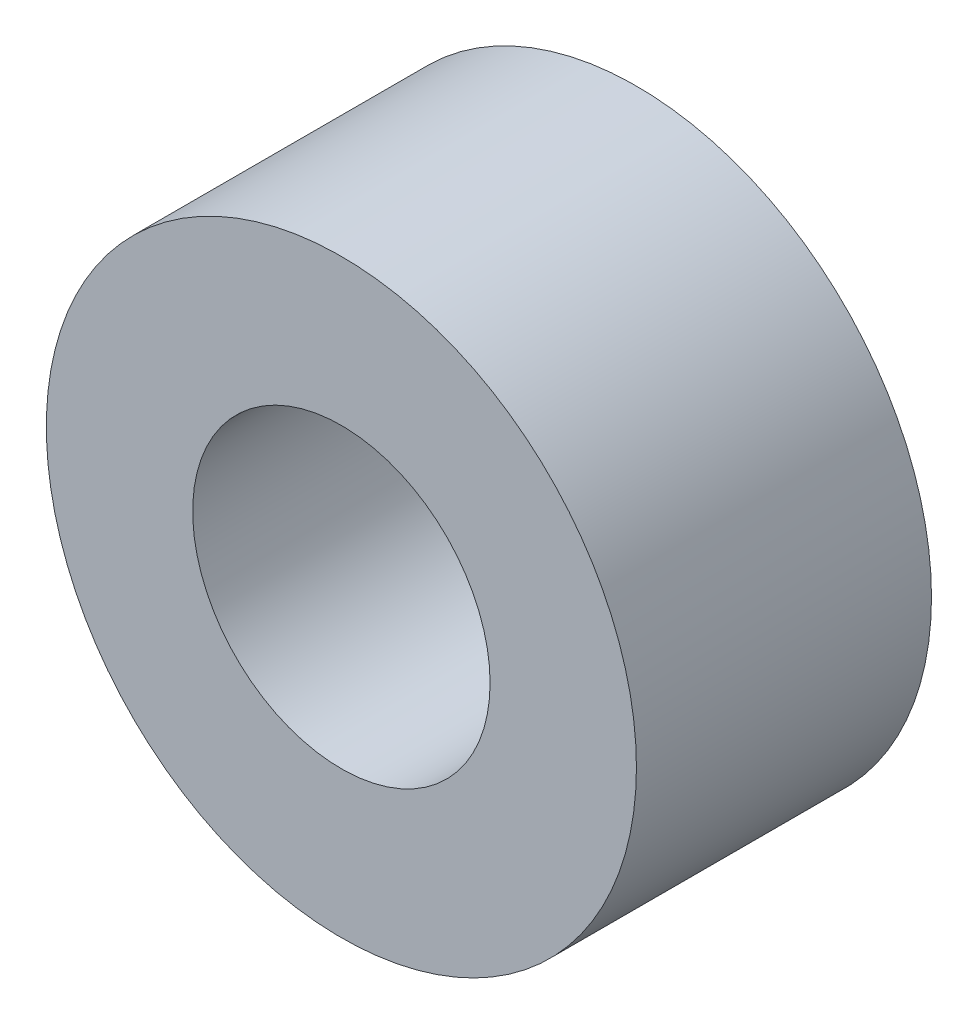
ISO-10303-21;
HEADER;
FILE_DESCRIPTION(('STEP AP214'),'2;1');
FILE_NAME('part.step','',(''),(''),'','','');
FILE_SCHEMA(('AUTOMOTIVE_DESIGN { 1 0 10303 214 1 1 1 1 }'));
ENDSEC;
DATA;
#1=APPLICATION_CONTEXT('core data for automotive mechanical design processes');
#2=APPLICATION_PROTOCOL_DEFINITION('international standard','automotive_design',2000,#1);
#3=PRODUCT_CONTEXT('',#1,'mechanical');
#4=PRODUCT('Part','Part','',(#3));
#5=PRODUCT_RELATED_PRODUCT_CATEGORY('part','',(#4));
#6=PRODUCT_DEFINITION_FORMATION('','',#4);
#7=PRODUCT_DEFINITION_CONTEXT('part definition',#1,'design');
#8=PRODUCT_DEFINITION('design','',#6,#7);
#9=PRODUCT_DEFINITION_SHAPE('','',#8);
#10=(LENGTH_UNIT() NAMED_UNIT(*) SI_UNIT(.MILLI.,.METRE.));
#11=(NAMED_UNIT(*) PLANE_ANGLE_UNIT() SI_UNIT($,.RADIAN.));
#12=(NAMED_UNIT(*) SI_UNIT($,.STERADIAN.) SOLID_ANGLE_UNIT());
#13=UNCERTAINTY_MEASURE_WITH_UNIT(LENGTH_MEASURE(1.E-05),#10,'distance_accuracy_value','');
#14=(GEOMETRIC_REPRESENTATION_CONTEXT(3) GLOBAL_UNCERTAINTY_ASSIGNED_CONTEXT((#13)) GLOBAL_UNIT_ASSIGNED_CONTEXT((#10,
#11,#12)) REPRESENTATION_CONTEXT('',''));
#15=CARTESIAN_POINT('',(0.,0.,0.));
#16=DIRECTION('',(0.,0.,1.));
#17=DIRECTION('',(1.,0.,0.));
#18=AXIS2_PLACEMENT_3D('',#15,#16,#17);
#19=CARTESIAN_POINT('',(0.,0.,3.175));
#20=DIRECTION('',(0.,0.,1.));
#21=DIRECTION('',(1.,0.,0.));
#22=AXIS2_PLACEMENT_3D('',#19,#20,#21);
#23=PLANE('',#22);
#24=CARTESIAN_POINT('',(0.,0.,3.175));
#25=DIRECTION('',(0.,0.,1.));
#26=DIRECTION('',(1.,0.,0.));
#27=AXIS2_PLACEMENT_3D('',#24,#25,#26);
#28=CIRCLE('',#27,6.35);
#29=CARTESIAN_POINT('',(6.35,0.,3.175));
#30=VERTEX_POINT('',#29);
#31=EDGE_CURVE('E10',#30,#30,#28,.T.);
#32=ORIENTED_EDGE('',*,*,#31,.T.);
#33=EDGE_LOOP('',(#32));
#34=FACE_BOUND('',#33,.T.);
#35=CARTESIAN_POINT('',(0.,0.,3.175));
#36=DIRECTION('',(0.,0.,1.));
#37=DIRECTION('',(1.,0.,0.));
#38=AXIS2_PLACEMENT_3D('',#35,#36,#37);
#39=CIRCLE('',#38,3.2004);
#40=CARTESIAN_POINT('',(3.2004,0.,3.175));
#41=VERTEX_POINT('',#40);
#42=EDGE_CURVE('E37',#41,#41,#39,.T.);
#43=ORIENTED_EDGE('',*,*,#42,.F.);
#44=EDGE_LOOP('',(#43));
#45=FACE_BOUND('',#44,.T.);
#46=ADVANCED_FACE('F30',(#34,#45),#23,.T.);
#47=CARTESIAN_POINT('',(0.,0.,3.175));
#48=DIRECTION('',(0.,0.,-1.));
#49=DIRECTION('',(-1.,0.,0.));
#50=AXIS2_PLACEMENT_3D('',#47,#48,#49);
#51=CYLINDRICAL_SURFACE('',#50,6.35);
#52=ORIENTED_EDGE('',*,*,#31,.F.);
#53=EDGE_LOOP('',(#52));
#54=FACE_BOUND('',#53,.T.);
#55=CARTESIAN_POINT('',(0.,0.,-3.175));
#56=DIRECTION('',(0.,0.,1.));
#57=DIRECTION('',(1.,0.,0.));
#58=AXIS2_PLACEMENT_3D('',#55,#56,#57);
#59=CIRCLE('',#58,6.35);
#60=CARTESIAN_POINT('',(6.35,0.,-3.175));
#61=VERTEX_POINT('',#60);
#62=EDGE_CURVE('E41',#61,#61,#59,.T.);
#63=ORIENTED_EDGE('',*,*,#62,.T.);
#64=EDGE_LOOP('',(#63));
#65=FACE_BOUND('',#64,.T.);
#66=ADVANCED_FACE('F32',(#54,#65),#51,.T.);
#67=CARTESIAN_POINT('',(0.,0.,3.175));
#68=DIRECTION('',(0.,0.,-1.));
#69=DIRECTION('',(-1.,0.,0.));
#70=AXIS2_PLACEMENT_3D('',#67,#68,#69);
#71=CYLINDRICAL_SURFACE('',#70,3.2004);
#72=ORIENTED_EDGE('',*,*,#42,.T.);
#73=EDGE_LOOP('',(#72));
#74=FACE_BOUND('',#73,.T.);
#75=CARTESIAN_POINT('',(0.,0.,-3.175));
#76=DIRECTION('',(0.,0.,1.));
#77=DIRECTION('',(1.,0.,0.));
#78=AXIS2_PLACEMENT_3D('',#75,#76,#77);
#79=CIRCLE('',#78,3.2004);
#80=CARTESIAN_POINT('',(3.2004,0.,-3.175));
#81=VERTEX_POINT('',#80);
#82=EDGE_CURVE('E45',#81,#81,#79,.T.);
#83=ORIENTED_EDGE('',*,*,#82,.F.);
#84=EDGE_LOOP('',(#83));
#85=FACE_BOUND('',#84,.T.);
#86=ADVANCED_FACE('F54',(#74,#85),#71,.F.);
#87=CARTESIAN_POINT('',(0.,0.,-3.175));
#88=DIRECTION('',(0.,0.,1.));
#89=DIRECTION('',(1.,0.,0.));
#90=AXIS2_PLACEMENT_3D('',#87,#88,#89);
#91=PLANE('',#90);
#92=ORIENTED_EDGE('',*,*,#82,.T.);
#93=EDGE_LOOP('',(#92));
#94=FACE_BOUND('',#93,.T.);
#95=ORIENTED_EDGE('',*,*,#62,.F.);
#96=EDGE_LOOP('',(#95));
#97=FACE_BOUND('',#96,.T.);
#98=ADVANCED_FACE('F51',(#94,#97),#91,.F.);
#99=CLOSED_SHELL('',(#46,#66,#86,#98));
#100=MANIFOLD_SOLID_BREP('B2',#99);
#101=ADVANCED_BREP_SHAPE_REPRESENTATION('',(#18,#100),#14);
#102=SHAPE_DEFINITION_REPRESENTATION(#9,#101);
ENDSEC;
END-ISO-10303-21;
